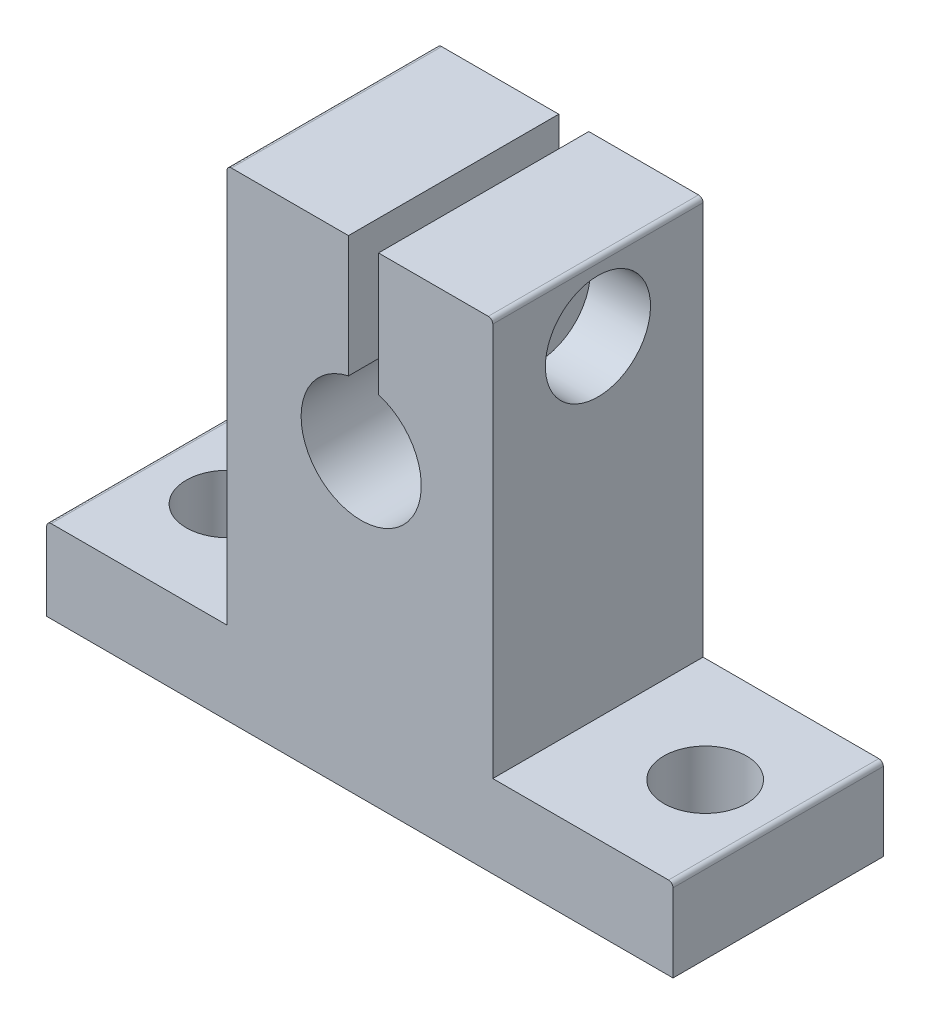
ISO-10303-21;
HEADER;
FILE_DESCRIPTION(('STEP AP214'),'2;1');
FILE_NAME('part.step','',(''),(''),'','','');
FILE_SCHEMA(('AUTOMOTIVE_DESIGN { 1 0 10303 214 1 1 1 1 }'));
ENDSEC;
DATA;
#1=APPLICATION_CONTEXT('core data for automotive mechanical design processes');
#2=APPLICATION_PROTOCOL_DEFINITION('international standard','automotive_design',2000,#1);
#3=PRODUCT_CONTEXT('',#1,'mechanical');
#4=PRODUCT('Part','Part','',(#3));
#5=PRODUCT_RELATED_PRODUCT_CATEGORY('part','',(#4));
#6=PRODUCT_DEFINITION_FORMATION('','',#4);
#7=PRODUCT_DEFINITION_CONTEXT('part definition',#1,'design');
#8=PRODUCT_DEFINITION('design','',#6,#7);
#9=PRODUCT_DEFINITION_SHAPE('','',#8);
#10=(LENGTH_UNIT() NAMED_UNIT(*) SI_UNIT(.MILLI.,.METRE.));
#11=(NAMED_UNIT(*) PLANE_ANGLE_UNIT() SI_UNIT($,.RADIAN.));
#12=(NAMED_UNIT(*) SI_UNIT($,.STERADIAN.) SOLID_ANGLE_UNIT());
#13=UNCERTAINTY_MEASURE_WITH_UNIT(LENGTH_MEASURE(1.E-05),#10,'distance_accuracy_value','');
#14=(GEOMETRIC_REPRESENTATION_CONTEXT(3) GLOBAL_UNCERTAINTY_ASSIGNED_CONTEXT((#13)) GLOBAL_UNIT_ASSIGNED_CONTEXT((#10,
#11,#12)) REPRESENTATION_CONTEXT('',''));
#15=CARTESIAN_POINT('',(0.,0.,0.));
#16=DIRECTION('',(0.,0.,1.));
#17=DIRECTION('',(1.,0.,0.));
#18=AXIS2_PLACEMENT_3D('',#15,#16,#17);
#19=CARTESIAN_POINT('',(-0.238905162453727,22.7864033921109,7.));
#20=DIRECTION('',(1.,0.,0.));
#21=DIRECTION('',(0.,1.,0.));
#22=AXIS2_PLACEMENT_3D('',#19,#20,#21);
#23=CYLINDRICAL_SURFACE('',#22,2.);
#24=CARTESIAN_POINT('',(1.15263000144478,22.7864033921109,7.));
#25=DIRECTION('',(1.,0.,0.));
#26=DIRECTION('',(0.,0.,-1.));
#27=AXIS2_PLACEMENT_3D('',#24,#25,#26);
#28=CIRCLE('',#27,2.);
#29=CARTESIAN_POINT('',(1.15263000144478,22.7864033921109,5.));
#30=VERTEX_POINT('',#29);
#31=EDGE_CURVE('E167',#30,#30,#28,.T.);
#32=ORIENTED_EDGE('',*,*,#31,.F.);
#33=EDGE_LOOP('',(#32));
#34=FACE_BOUND('',#33,.T.);
#35=CARTESIAN_POINT('',(4.76109483754627,22.7864033921109,7.));
#36=DIRECTION('',(1.,0.,0.));
#37=DIRECTION('',(0.,1.,0.));
#38=AXIS2_PLACEMENT_3D('',#35,#36,#37);
#39=CIRCLE('',#38,2.);
#40=CARTESIAN_POINT('',(4.76109483754627,24.7864033921109,7.));
#41=VERTEX_POINT('',#40);
#42=EDGE_CURVE('E236',#41,#41,#39,.F.);
#43=ORIENTED_EDGE('',*,*,#42,.F.);
#44=EDGE_LOOP('',(#43));
#45=FACE_BOUND('',#44,.T.);
#46=ADVANCED_FACE('F32',(#34,#45),#23,.F.);
#47=CARTESIAN_POINT('',(-8.93890516245373,27.2864033921109,14.));
#48=DIRECTION('',(0.,-1.,0.));
#49=DIRECTION('',(1.,0.,0.));
#50=AXIS2_PLACEMENT_3D('',#47,#48,#49);
#51=PLANE('',#50);
#52=DIRECTION('',(-1.,0.,0.));
#53=VECTOR('',#52,1.);
#54=CARTESIAN_POINT('',(-8.93890516245373,27.2864033921109,14.));
#55=LINE('',#54,#53);
#56=CARTESIAN_POINT('',(8.46109483754627,27.2864033921109,14.));
#57=VERTEX_POINT('',#56);
#58=CARTESIAN_POINT('',(1.15263000144478,27.2864033921109,14.));
#59=VERTEX_POINT('',#58);
#60=EDGE_CURVE('E165',#57,#59,#55,.T.);
#61=ORIENTED_EDGE('',*,*,#60,.F.);
#62=DIRECTION('',(0.,0.,-1.));
#63=VECTOR('',#62,1.);
#64=CARTESIAN_POINT('',(8.46109483754627,27.2864033921109,14.));
#65=LINE('',#64,#63);
#66=CARTESIAN_POINT('',(8.46109483754627,27.2864033921109,0.));
#67=VERTEX_POINT('',#66);
#68=EDGE_CURVE('E40',#57,#67,#65,.T.);
#69=ORIENTED_EDGE('',*,*,#68,.T.);
#70=DIRECTION('',(-1.,0.,0.));
#71=VECTOR('',#70,1.);
#72=CARTESIAN_POINT('',(-8.93890516245373,27.2864033921109,0.));
#73=LINE('',#72,#71);
#74=CARTESIAN_POINT('',(1.15263000144478,27.2864033921109,0.));
#75=VERTEX_POINT('',#74);
#76=EDGE_CURVE('E206',#67,#75,#73,.T.);
#77=ORIENTED_EDGE('',*,*,#76,.T.);
#78=DIRECTION('',(0.,0.,1.));
#79=VECTOR('',#78,1.);
#80=CARTESIAN_POINT('',(1.15263000144478,27.2864033921109,14.));
#81=LINE('',#80,#79);
#82=EDGE_CURVE('E294',#75,#59,#81,.T.);
#83=ORIENTED_EDGE('',*,*,#82,.T.);
#84=EDGE_LOOP('',(#61,#69,#77,#83));
#85=FACE_BOUND('',#84,.T.);
#86=ADVANCED_FACE('F277',(#85),#51,.F.);
#87=CARTESIAN_POINT('',(0.,0.,14.));
#88=DIRECTION('',(0.,0.,1.));
#89=DIRECTION('',(1.,0.,0.));
#90=AXIS2_PLACEMENT_3D('',#87,#88,#89);
#91=PLANE('',#90);
#92=DIRECTION('',(-1.,0.,0.));
#93=VECTOR('',#92,1.);
#94=CARTESIAN_POINT('',(-20.9389051624537,0.786403392110909,14.));
#95=LINE('',#94,#93);
#96=CARTESIAN_POINT('',(-8.93890516245373,0.786403392110911,14.));
#97=VERTEX_POINT('',#96);
#98=CARTESIAN_POINT('',(-20.6389051624537,0.786403392110909,14.));
#99=VERTEX_POINT('',#98);
#100=EDGE_CURVE('E195',#97,#99,#95,.T.);
#101=ORIENTED_EDGE('',*,*,#100,.T.);
#102=CARTESIAN_POINT('',(-20.6389051624537,0.48640339211091,14.));
#103=DIRECTION('',(0.,0.,1.));
#104=DIRECTION('',(1.,0.,0.));
#105=AXIS2_PLACEMENT_3D('',#102,#103,#104);
#106=CIRCLE('',#105,0.3);
#107=CARTESIAN_POINT('',(-20.9389051624537,0.48640339211091,14.));
#108=VERTEX_POINT('',#107);
#109=EDGE_CURVE('E262',#99,#108,#106,.T.);
#110=ORIENTED_EDGE('',*,*,#109,.T.);
#111=DIRECTION('',(0.,-1.,0.));
#112=VECTOR('',#111,1.);
#113=CARTESIAN_POINT('',(-20.9389051624537,0.786403392110909,14.));
#114=LINE('',#113,#112);
#115=CARTESIAN_POINT('',(-20.9389051624537,-4.71359660788909,14.));
#116=VERTEX_POINT('',#115);
#117=EDGE_CURVE('E197',#108,#116,#114,.T.);
#118=ORIENTED_EDGE('',*,*,#117,.T.);
#119=DIRECTION('',(1.,0.,0.));
#120=VECTOR('',#119,1.);
#121=CARTESIAN_POINT('',(-20.9389051624537,-4.71359660788909,14.));
#122=LINE('',#121,#120);
#123=CARTESIAN_POINT('',(20.7610948375463,-4.71359660788909,14.));
#124=VERTEX_POINT('',#123);
#125=EDGE_CURVE('E199',#116,#124,#122,.T.);
#126=ORIENTED_EDGE('',*,*,#125,.T.);
#127=DIRECTION('',(0.,1.,0.));
#128=VECTOR('',#127,1.);
#129=CARTESIAN_POINT('',(20.7610948375463,0.786403392110909,14.));
#130=LINE('',#129,#128);
#131=CARTESIAN_POINT('',(20.7610948375463,0.486403392110909,14.));
#132=VERTEX_POINT('',#131);
#133=EDGE_CURVE('E183',#124,#132,#130,.T.);
#134=ORIENTED_EDGE('',*,*,#133,.T.);
#135=CARTESIAN_POINT('',(20.4610948375463,0.486403392110909,14.));
#136=DIRECTION('',(0.,0.,1.));
#137=DIRECTION('',(1.,0.,0.));
#138=AXIS2_PLACEMENT_3D('',#135,#136,#137);
#139=CIRCLE('',#138,0.3);
#140=CARTESIAN_POINT('',(20.4610948375463,0.786403392110909,14.));
#141=VERTEX_POINT('',#140);
#142=EDGE_CURVE('E260',#132,#141,#139,.T.);
#143=ORIENTED_EDGE('',*,*,#142,.T.);
#144=DIRECTION('',(-1.,0.,0.));
#145=VECTOR('',#144,1.);
#146=CARTESIAN_POINT('',(8.76109483754628,0.786403392110909,14.));
#147=LINE('',#146,#145);
#148=CARTESIAN_POINT('',(8.76109483754628,0.786403392110909,14.));
#149=VERTEX_POINT('',#148);
#150=EDGE_CURVE('E186',#141,#149,#147,.T.);
#151=ORIENTED_EDGE('',*,*,#150,.T.);
#152=DIRECTION('',(0.,1.,0.));
#153=VECTOR('',#152,1.);
#154=CARTESIAN_POINT('',(8.76109483754627,27.2864033921109,14.));
#155=LINE('',#154,#153);
#156=CARTESIAN_POINT('',(8.76109483754627,26.9864033921109,14.));
#157=VERTEX_POINT('',#156);
#158=EDGE_CURVE('E189',#149,#157,#155,.T.);
#159=ORIENTED_EDGE('',*,*,#158,.T.);
#160=CARTESIAN_POINT('',(8.46109483754627,26.9864033921109,14.));
#161=DIRECTION('',(0.,0.,1.));
#162=DIRECTION('',(1.,0.,0.));
#163=AXIS2_PLACEMENT_3D('',#160,#161,#162);
#164=CIRCLE('',#163,0.3);
#165=EDGE_CURVE('E47',#157,#57,#164,.T.);
#166=ORIENTED_EDGE('',*,*,#165,.T.);
#167=ORIENTED_EDGE('',*,*,#60,.T.);
#168=DIRECTION('',(0.,1.,0.));
#169=VECTOR('',#168,1.);
#170=CARTESIAN_POINT('',(1.15263000144478,29.6829816442185,14.));
#171=LINE('',#170,#169);
#172=CARTESIAN_POINT('',(1.15263000144478,19.116735503008,14.));
#173=VERTEX_POINT('',#172);
#174=EDGE_CURVE('E149',#173,#59,#171,.T.);
#175=ORIENTED_EDGE('',*,*,#174,.F.);
#176=CARTESIAN_POINT('',(0.,15.2864033921109,14.));
#177=DIRECTION('',(0.,0.,1.));
#178=DIRECTION('',(1.,0.,0.));
#179=AXIS2_PLACEMENT_3D('',#176,#177,#178);
#180=CIRCLE('',#179,4.);
#181=CARTESIAN_POINT('',(-0.847369998555217,19.1956186695737,14.));
#182=VERTEX_POINT('',#181);
#183=EDGE_CURVE('E164',#182,#173,#180,.T.);
#184=ORIENTED_EDGE('',*,*,#183,.F.);
#185=DIRECTION('',(0.,-1.,0.));
#186=VECTOR('',#185,1.);
#187=CARTESIAN_POINT('',(-0.847369998555218,29.6829816442185,14.));
#188=LINE('',#187,#186);
#189=CARTESIAN_POINT('',(-0.847369998555218,27.2864033921109,14.));
#190=VERTEX_POINT('',#189);
#191=EDGE_CURVE('E166',#190,#182,#188,.T.);
#192=ORIENTED_EDGE('',*,*,#191,.F.);
#193=CARTESIAN_POINT('',(-8.63890516245373,27.2864033921109,14.));
#194=VERTEX_POINT('',#193);
#195=EDGE_CURVE('E191',#190,#194,#55,.T.);
#196=ORIENTED_EDGE('',*,*,#195,.T.);
#197=CARTESIAN_POINT('',(-8.63890516245373,26.9864033921109,14.));
#198=DIRECTION('',(0.,0.,1.));
#199=DIRECTION('',(1.,0.,0.));
#200=AXIS2_PLACEMENT_3D('',#197,#198,#199);
#201=CIRCLE('',#200,0.3);
#202=CARTESIAN_POINT('',(-8.93890516245373,26.9864033921109,14.));
#203=VERTEX_POINT('',#202);
#204=EDGE_CURVE('E258',#194,#203,#201,.T.);
#205=ORIENTED_EDGE('',*,*,#204,.T.);
#206=DIRECTION('',(0.,-1.,0.));
#207=VECTOR('',#206,1.);
#208=CARTESIAN_POINT('',(-8.93890516245373,27.2864033921109,14.));
#209=LINE('',#208,#207);
#210=EDGE_CURVE('E193',#203,#97,#209,.T.);
#211=ORIENTED_EDGE('',*,*,#210,.T.);
#212=EDGE_LOOP('',(#101,#110,#118,#126,#134,#143,#151,#159,#166,#167,#175,#184,#192,#196,#205,#211));
#213=FACE_BOUND('',#212,.T.);
#214=ADVANCED_FACE('F162',(#213),#91,.T.);
#215=CARTESIAN_POINT('',(0.,0.,0.));
#216=DIRECTION('',(0.,0.,1.));
#217=DIRECTION('',(1.,0.,0.));
#218=AXIS2_PLACEMENT_3D('',#215,#216,#217);
#219=PLANE('',#218);
#220=DIRECTION('',(0.,-1.,0.));
#221=VECTOR('',#220,1.);
#222=CARTESIAN_POINT('',(-20.9389051624537,0.786403392110909,0.));
#223=LINE('',#222,#221);
#224=CARTESIAN_POINT('',(-20.9389051624537,0.48640339211091,0.));
#225=VERTEX_POINT('',#224);
#226=CARTESIAN_POINT('',(-20.9389051624537,-4.71359660788909,0.));
#227=VERTEX_POINT('',#226);
#228=EDGE_CURVE('E213',#225,#227,#223,.T.);
#229=ORIENTED_EDGE('',*,*,#228,.F.);
#230=CARTESIAN_POINT('',(-20.6389051624537,0.48640339211091,0.));
#231=DIRECTION('',(0.,0.,1.));
#232=DIRECTION('',(1.,0.,0.));
#233=AXIS2_PLACEMENT_3D('',#230,#231,#232);
#234=CIRCLE('',#233,0.3);
#235=CARTESIAN_POINT('',(-20.6389051624537,0.786403392110909,0.));
#236=VERTEX_POINT('',#235);
#237=EDGE_CURVE('E253',#225,#236,#234,.F.);
#238=ORIENTED_EDGE('',*,*,#237,.T.);
#239=DIRECTION('',(-1.,0.,0.));
#240=VECTOR('',#239,1.);
#241=CARTESIAN_POINT('',(-20.9389051624537,0.786403392110909,0.));
#242=LINE('',#241,#240);
#243=CARTESIAN_POINT('',(-8.93890516245373,0.786403392110911,0.));
#244=VERTEX_POINT('',#243);
#245=EDGE_CURVE('E210',#244,#236,#242,.T.);
#246=ORIENTED_EDGE('',*,*,#245,.F.);
#247=DIRECTION('',(0.,-1.,0.));
#248=VECTOR('',#247,1.);
#249=CARTESIAN_POINT('',(-8.93890516245373,27.2864033921109,0.));
#250=LINE('',#249,#248);
#251=CARTESIAN_POINT('',(-8.93890516245373,26.9864033921109,0.));
#252=VERTEX_POINT('',#251);
#253=EDGE_CURVE('E208',#252,#244,#250,.T.);
#254=ORIENTED_EDGE('',*,*,#253,.F.);
#255=CARTESIAN_POINT('',(-8.63890516245373,26.9864033921109,0.));
#256=DIRECTION('',(0.,0.,1.));
#257=DIRECTION('',(1.,0.,0.));
#258=AXIS2_PLACEMENT_3D('',#255,#256,#257);
#259=CIRCLE('',#258,0.3);
#260=CARTESIAN_POINT('',(-8.63890516245373,27.2864033921109,0.));
#261=VERTEX_POINT('',#260);
#262=EDGE_CURVE('E249',#252,#261,#259,.F.);
#263=ORIENTED_EDGE('',*,*,#262,.T.);
#264=CARTESIAN_POINT('',(-0.847369998555218,27.2864033921109,0.));
#265=VERTEX_POINT('',#264);
#266=EDGE_CURVE('E205',#265,#261,#73,.T.);
#267=ORIENTED_EDGE('',*,*,#266,.F.);
#268=DIRECTION('',(0.,-1.,0.));
#269=VECTOR('',#268,1.);
#270=CARTESIAN_POINT('',(-0.847369998555218,29.6829816442185,0.));
#271=LINE('',#270,#269);
#272=CARTESIAN_POINT('',(-0.847369998555217,19.1956186695737,0.));
#273=VERTEX_POINT('',#272);
#274=EDGE_CURVE('E284',#265,#273,#271,.T.);
#275=ORIENTED_EDGE('',*,*,#274,.T.);
#276=CARTESIAN_POINT('',(0.,15.2864033921109,0.));
#277=DIRECTION('',(0.,0.,1.));
#278=DIRECTION('',(1.,0.,0.));
#279=AXIS2_PLACEMENT_3D('',#276,#277,#278);
#280=CIRCLE('',#279,4.);
#281=CARTESIAN_POINT('',(1.15263000144478,19.116735503008,0.));
#282=VERTEX_POINT('',#281);
#283=EDGE_CURVE('E172',#273,#282,#280,.T.);
#284=ORIENTED_EDGE('',*,*,#283,.T.);
#285=DIRECTION('',(0.,1.,0.));
#286=VECTOR('',#285,1.);
#287=CARTESIAN_POINT('',(1.15263000144478,29.6829816442185,0.));
#288=LINE('',#287,#286);
#289=EDGE_CURVE('E152',#282,#75,#288,.T.);
#290=ORIENTED_EDGE('',*,*,#289,.T.);
#291=ORIENTED_EDGE('',*,*,#76,.F.);
#292=CARTESIAN_POINT('',(8.46109483754627,26.9864033921109,0.));
#293=DIRECTION('',(0.,0.,1.));
#294=DIRECTION('',(1.,0.,0.));
#295=AXIS2_PLACEMENT_3D('',#292,#293,#294);
#296=CIRCLE('',#295,0.3);
#297=CARTESIAN_POINT('',(8.76109483754627,26.9864033921109,0.));
#298=VERTEX_POINT('',#297);
#299=EDGE_CURVE('E247',#67,#298,#296,.F.);
#300=ORIENTED_EDGE('',*,*,#299,.T.);
#301=DIRECTION('',(0.,1.,0.));
#302=VECTOR('',#301,1.);
#303=CARTESIAN_POINT('',(8.76109483754627,27.2864033921109,0.));
#304=LINE('',#303,#302);
#305=CARTESIAN_POINT('',(8.76109483754628,0.786403392110909,0.));
#306=VERTEX_POINT('',#305);
#307=EDGE_CURVE('E203',#306,#298,#304,.T.);
#308=ORIENTED_EDGE('',*,*,#307,.F.);
#309=DIRECTION('',(-1.,0.,0.));
#310=VECTOR('',#309,1.);
#311=CARTESIAN_POINT('',(8.76109483754628,0.786403392110909,0.));
#312=LINE('',#311,#310);
#313=CARTESIAN_POINT('',(20.4610948375463,0.786403392110909,0.));
#314=VERTEX_POINT('',#313);
#315=EDGE_CURVE('E175',#314,#306,#312,.T.);
#316=ORIENTED_EDGE('',*,*,#315,.F.);
#317=CARTESIAN_POINT('',(20.4610948375463,0.486403392110909,0.));
#318=DIRECTION('',(0.,0.,1.));
#319=DIRECTION('',(1.,0.,0.));
#320=AXIS2_PLACEMENT_3D('',#317,#318,#319);
#321=CIRCLE('',#320,0.3);
#322=CARTESIAN_POINT('',(20.7610948375463,0.486403392110909,0.));
#323=VERTEX_POINT('',#322);
#324=EDGE_CURVE('E251',#314,#323,#321,.F.);
#325=ORIENTED_EDGE('',*,*,#324,.T.);
#326=DIRECTION('',(0.,1.,0.));
#327=VECTOR('',#326,1.);
#328=CARTESIAN_POINT('',(20.7610948375463,0.786403392110909,0.));
#329=LINE('',#328,#327);
#330=CARTESIAN_POINT('',(20.7610948375463,-4.71359660788909,0.));
#331=VERTEX_POINT('',#330);
#332=EDGE_CURVE('E171',#331,#323,#329,.T.);
#333=ORIENTED_EDGE('',*,*,#332,.F.);
#334=DIRECTION('',(1.,0.,0.));
#335=VECTOR('',#334,1.);
#336=CARTESIAN_POINT('',(-20.9389051624537,-4.71359660788909,0.));
#337=LINE('',#336,#335);
#338=EDGE_CURVE('E187',#227,#331,#337,.T.);
#339=ORIENTED_EDGE('',*,*,#338,.F.);
#340=EDGE_LOOP('',(#229,#238,#246,#254,#263,#267,#275,#284,#290,#291,#300,#308,#316,#325,#333,#339));
#341=FACE_BOUND('',#340,.T.);
#342=ADVANCED_FACE('F281',(#341),#219,.F.);
#343=CARTESIAN_POINT('',(20.7610948375463,0.786403392110909,14.));
#344=DIRECTION('',(-1.,0.,0.));
#345=DIRECTION('',(0.,0.,1.));
#346=AXIS2_PLACEMENT_3D('',#343,#344,#345);
#347=PLANE('',#346);
#348=ORIENTED_EDGE('',*,*,#332,.T.);
#349=DIRECTION('',(0.,0.,-1.));
#350=VECTOR('',#349,1.);
#351=CARTESIAN_POINT('',(20.7610948375463,0.486403392110909,14.));
#352=LINE('',#351,#350);
#353=EDGE_CURVE('E267',#323,#132,#352,.F.);
#354=ORIENTED_EDGE('',*,*,#353,.T.);
#355=ORIENTED_EDGE('',*,*,#133,.F.);
#356=DIRECTION('',(0.,0.,-1.));
#357=VECTOR('',#356,1.);
#358=CARTESIAN_POINT('',(20.7610948375463,-4.71359660788909,14.));
#359=LINE('',#358,#357);
#360=EDGE_CURVE('E200',#124,#331,#359,.T.);
#361=ORIENTED_EDGE('',*,*,#360,.T.);
#362=EDGE_LOOP('',(#348,#354,#355,#361));
#363=FACE_BOUND('',#362,.T.);
#364=ADVANCED_FACE('F305',(#363),#347,.F.);
#365=CARTESIAN_POINT('',(8.76109483754628,0.786403392110909,14.));
#366=DIRECTION('',(0.,-1.,0.));
#367=DIRECTION('',(0.,0.,-1.));
#368=AXIS2_PLACEMENT_3D('',#365,#366,#367);
#369=PLANE('',#368);
#370=CARTESIAN_POINT('',(15.9,0.786403392110909,7.));
#371=DIRECTION('',(0.,1.,0.));
#372=DIRECTION('',(0.,0.,1.));
#373=AXIS2_PLACEMENT_3D('',#370,#371,#372);
#374=CIRCLE('',#373,2.75);
#375=CARTESIAN_POINT('',(15.9,0.786403392110909,9.75));
#376=VERTEX_POINT('',#375);
#377=EDGE_CURVE('E232',#376,#376,#374,.T.);
#378=ORIENTED_EDGE('',*,*,#377,.F.);
#379=EDGE_LOOP('',(#378));
#380=FACE_BOUND('',#379,.T.);
#381=ORIENTED_EDGE('',*,*,#150,.F.);
#382=DIRECTION('',(0.,0.,-1.));
#383=VECTOR('',#382,1.);
#384=CARTESIAN_POINT('',(20.4610948375463,0.786403392110909,14.));
#385=LINE('',#384,#383);
#386=EDGE_CURVE('E264',#141,#314,#385,.T.);
#387=ORIENTED_EDGE('',*,*,#386,.T.);
#388=ORIENTED_EDGE('',*,*,#315,.T.);
#389=DIRECTION('',(0.,0.,-1.));
#390=VECTOR('',#389,1.);
#391=CARTESIAN_POINT('',(8.76109483754628,0.786403392110909,14.));
#392=LINE('',#391,#390);
#393=EDGE_CURVE('E224',#149,#306,#392,.T.);
#394=ORIENTED_EDGE('',*,*,#393,.F.);
#395=EDGE_LOOP('',(#381,#387,#388,#394));
#396=FACE_BOUND('',#395,.T.);
#397=ADVANCED_FACE('F301',(#380,#396),#369,.F.);
#398=CARTESIAN_POINT('',(8.76109483754627,27.2864033921109,14.));
#399=DIRECTION('',(-1.,0.,0.));
#400=DIRECTION('',(0.,-1.,0.));
#401=AXIS2_PLACEMENT_3D('',#398,#399,#400);
#402=PLANE('',#401);
#403=CARTESIAN_POINT('',(8.76109483754627,22.7864033921109,7.));
#404=DIRECTION('',(1.,0.,0.));
#405=DIRECTION('',(0.,1.,0.));
#406=AXIS2_PLACEMENT_3D('',#403,#404,#405);
#407=CIRCLE('',#406,3.5);
#408=CARTESIAN_POINT('',(8.76109483754627,26.2864033921109,7.));
#409=VERTEX_POINT('',#408);
#410=EDGE_CURVE('E243',#409,#409,#407,.T.);
#411=ORIENTED_EDGE('',*,*,#410,.F.);
#412=EDGE_LOOP('',(#411));
#413=FACE_BOUND('',#412,.T.);
#414=ORIENTED_EDGE('',*,*,#307,.T.);
#415=DIRECTION('',(0.,0.,-1.));
#416=VECTOR('',#415,1.);
#417=CARTESIAN_POINT('',(8.76109483754627,26.9864033921109,14.));
#418=LINE('',#417,#416);
#419=EDGE_CURVE('E11',#298,#157,#418,.F.);
#420=ORIENTED_EDGE('',*,*,#419,.T.);
#421=ORIENTED_EDGE('',*,*,#158,.F.);
#422=ORIENTED_EDGE('',*,*,#393,.T.);
#423=EDGE_LOOP('',(#414,#420,#421,#422));
#424=FACE_BOUND('',#423,.T.);
#425=ADVANCED_FACE('F304',(#413,#424),#402,.F.);
#426=ORIENTED_EDGE('',*,*,#266,.T.);
#427=DIRECTION('',(0.,0.,-1.));
#428=VECTOR('',#427,1.);
#429=CARTESIAN_POINT('',(-8.63890516245373,27.2864033921109,14.));
#430=LINE('',#429,#428);
#431=EDGE_CURVE('E272',#261,#194,#430,.F.);
#432=ORIENTED_EDGE('',*,*,#431,.T.);
#433=ORIENTED_EDGE('',*,*,#195,.F.);
#434=DIRECTION('',(0.,0.,-1.));
#435=VECTOR('',#434,1.);
#436=CARTESIAN_POINT('',(-0.847369998555218,27.2864033921109,14.));
#437=LINE('',#436,#435);
#438=EDGE_CURVE('E286',#190,#265,#437,.T.);
#439=ORIENTED_EDGE('',*,*,#438,.T.);
#440=EDGE_LOOP('',(#426,#432,#433,#439));
#441=FACE_BOUND('',#440,.T.);
#442=ADVANCED_FACE('F349',(#441),#51,.F.);
#443=CARTESIAN_POINT('',(-8.93890516245373,27.2864033921109,14.));
#444=DIRECTION('',(1.,0.,0.));
#445=DIRECTION('',(0.,1.,0.));
#446=AXIS2_PLACEMENT_3D('',#443,#444,#445);
#447=PLANE('',#446);
#448=CARTESIAN_POINT('',(-8.93890516245373,22.7864033921109,7.));
#449=DIRECTION('',(-1.,0.,0.));
#450=DIRECTION('',(0.,-1.,0.));
#451=AXIS2_PLACEMENT_3D('',#448,#449,#450);
#452=CIRCLE('',#451,1.85);
#453=CARTESIAN_POINT('',(-8.93890516245373,20.9364033921109,7.));
#454=VERTEX_POINT('',#453);
#455=EDGE_CURVE('E244',#454,#454,#452,.T.);
#456=ORIENTED_EDGE('',*,*,#455,.F.);
#457=EDGE_LOOP('',(#456));
#458=FACE_BOUND('',#457,.T.);
#459=ORIENTED_EDGE('',*,*,#210,.F.);
#460=DIRECTION('',(0.,0.,-1.));
#461=VECTOR('',#460,1.);
#462=CARTESIAN_POINT('',(-8.93890516245373,26.9864033921109,14.));
#463=LINE('',#462,#461);
#464=EDGE_CURVE('E269',#203,#252,#463,.T.);
#465=ORIENTED_EDGE('',*,*,#464,.T.);
#466=ORIENTED_EDGE('',*,*,#253,.T.);
#467=DIRECTION('',(0.,0.,-1.));
#468=VECTOR('',#467,1.);
#469=CARTESIAN_POINT('',(-8.93890516245373,0.786403392110911,14.));
#470=LINE('',#469,#468);
#471=EDGE_CURVE('E221',#97,#244,#470,.T.);
#472=ORIENTED_EDGE('',*,*,#471,.F.);
#473=EDGE_LOOP('',(#459,#465,#466,#472));
#474=FACE_BOUND('',#473,.T.);
#475=ADVANCED_FACE('F342',(#458,#474),#447,.F.);
#476=CARTESIAN_POINT('',(-20.9389051624537,0.786403392110909,14.));
#477=DIRECTION('',(0.,-1.,0.));
#478=DIRECTION('',(1.,0.,0.));
#479=AXIS2_PLACEMENT_3D('',#476,#477,#478);
#480=PLANE('',#479);
#481=CARTESIAN_POINT('',(-15.9,0.786403392110909,7.));
#482=DIRECTION('',(0.,1.,0.));
#483=DIRECTION('',(0.,0.,1.));
#484=AXIS2_PLACEMENT_3D('',#481,#482,#483);
#485=CIRCLE('',#484,2.75);
#486=CARTESIAN_POINT('',(-15.9,0.786403392110909,9.75));
#487=VERTEX_POINT('',#486);
#488=EDGE_CURVE('E180',#487,#487,#485,.T.);
#489=ORIENTED_EDGE('',*,*,#488,.F.);
#490=EDGE_LOOP('',(#489));
#491=FACE_BOUND('',#490,.T.);
#492=ORIENTED_EDGE('',*,*,#245,.T.);
#493=DIRECTION('',(0.,0.,-1.));
#494=VECTOR('',#493,1.);
#495=CARTESIAN_POINT('',(-20.6389051624537,0.786403392110909,14.));
#496=LINE('',#495,#494);
#497=EDGE_CURVE('E255',#236,#99,#496,.F.);
#498=ORIENTED_EDGE('',*,*,#497,.T.);
#499=ORIENTED_EDGE('',*,*,#100,.F.);
#500=ORIENTED_EDGE('',*,*,#471,.T.);
#501=EDGE_LOOP('',(#492,#498,#499,#500));
#502=FACE_BOUND('',#501,.T.);
#503=ADVANCED_FACE('F335',(#491,#502),#480,.F.);
#504=CARTESIAN_POINT('',(-20.9389051624537,0.786403392110909,14.));
#505=DIRECTION('',(1.,0.,0.));
#506=DIRECTION('',(0.,0.,-1.));
#507=AXIS2_PLACEMENT_3D('',#504,#505,#506);
#508=PLANE('',#507);
#509=ORIENTED_EDGE('',*,*,#117,.F.);
#510=DIRECTION('',(0.,0.,-1.));
#511=VECTOR('',#510,1.);
#512=CARTESIAN_POINT('',(-20.9389051624537,0.48640339211091,14.));
#513=LINE('',#512,#511);
#514=EDGE_CURVE('E157',#108,#225,#513,.T.);
#515=ORIENTED_EDGE('',*,*,#514,.T.);
#516=ORIENTED_EDGE('',*,*,#228,.T.);
#517=DIRECTION('',(0.,0.,-1.));
#518=VECTOR('',#517,1.);
#519=CARTESIAN_POINT('',(-20.9389051624537,-4.71359660788909,14.));
#520=LINE('',#519,#518);
#521=EDGE_CURVE('E218',#116,#227,#520,.T.);
#522=ORIENTED_EDGE('',*,*,#521,.F.);
#523=EDGE_LOOP('',(#509,#515,#516,#522));
#524=FACE_BOUND('',#523,.T.);
#525=ADVANCED_FACE('F327',(#524),#508,.F.);
#526=CARTESIAN_POINT('',(-20.9389051624537,-4.71359660788909,14.));
#527=DIRECTION('',(0.,1.,0.));
#528=DIRECTION('',(0.,0.,1.));
#529=AXIS2_PLACEMENT_3D('',#526,#527,#528);
#530=PLANE('',#529);
#531=CARTESIAN_POINT('',(15.9,-4.71359660788909,7.));
#532=DIRECTION('',(0.,1.,0.));
#533=DIRECTION('',(0.,0.,1.));
#534=AXIS2_PLACEMENT_3D('',#531,#532,#533);
#535=CIRCLE('',#534,2.75);
#536=CARTESIAN_POINT('',(15.9,-4.71359660788909,9.75));
#537=VERTEX_POINT('',#536);
#538=EDGE_CURVE('E229',#537,#537,#535,.T.);
#539=ORIENTED_EDGE('',*,*,#538,.T.);
#540=EDGE_LOOP('',(#539));
#541=FACE_BOUND('',#540,.T.);
#542=CARTESIAN_POINT('',(-15.9,-4.71359660788909,7.));
#543=DIRECTION('',(0.,1.,0.));
#544=DIRECTION('',(0.,0.,1.));
#545=AXIS2_PLACEMENT_3D('',#542,#543,#544);
#546=CIRCLE('',#545,2.75);
#547=CARTESIAN_POINT('',(-15.9,-4.71359660788909,9.75));
#548=VERTEX_POINT('',#547);
#549=EDGE_CURVE('E177',#548,#548,#546,.T.);
#550=ORIENTED_EDGE('',*,*,#549,.T.);
#551=EDGE_LOOP('',(#550));
#552=FACE_BOUND('',#551,.T.);
#553=ORIENTED_EDGE('',*,*,#338,.T.);
#554=ORIENTED_EDGE('',*,*,#360,.F.);
#555=ORIENTED_EDGE('',*,*,#125,.F.);
#556=ORIENTED_EDGE('',*,*,#521,.T.);
#557=EDGE_LOOP('',(#553,#554,#555,#556));
#558=FACE_BOUND('',#557,.T.);
#559=ADVANCED_FACE('F322',(#541,#552,#558),#530,.F.);
#560=CARTESIAN_POINT('',(0.,15.2864033921109,14.));
#561=DIRECTION('',(0.,0.,-1.));
#562=DIRECTION('',(-1.,0.,0.));
#563=AXIS2_PLACEMENT_3D('',#560,#561,#562);
#564=CYLINDRICAL_SURFACE('',#563,4.);
#565=DIRECTION('',(0.,0.,-1.));
#566=VECTOR('',#565,1.);
#567=CARTESIAN_POINT('',(1.15263000144478,19.116735503008,14.));
#568=LINE('',#567,#566);
#569=EDGE_CURVE('E145',#282,#173,#568,.F.);
#570=ORIENTED_EDGE('',*,*,#569,.F.);
#571=ORIENTED_EDGE('',*,*,#283,.F.);
#572=DIRECTION('',(0.,0.,-1.));
#573=VECTOR('',#572,1.);
#574=CARTESIAN_POINT('',(-0.847369998555217,19.1956186695737,14.));
#575=LINE('',#574,#573);
#576=EDGE_CURVE('E158',#182,#273,#575,.T.);
#577=ORIENTED_EDGE('',*,*,#576,.F.);
#578=ORIENTED_EDGE('',*,*,#183,.T.);
#579=EDGE_LOOP('',(#570,#571,#577,#578));
#580=FACE_BOUND('',#579,.T.);
#581=ADVANCED_FACE('F170',(#580),#564,.F.);
#582=CARTESIAN_POINT('',(-15.9,-5.21359660788909,7.));
#583=DIRECTION('',(0.,1.,0.));
#584=DIRECTION('',(0.,0.,1.));
#585=AXIS2_PLACEMENT_3D('',#582,#583,#584);
#586=CYLINDRICAL_SURFACE('',#585,2.75);
#587=ORIENTED_EDGE('',*,*,#488,.T.);
#588=EDGE_LOOP('',(#587));
#589=FACE_BOUND('',#588,.T.);
#590=ORIENTED_EDGE('',*,*,#549,.F.);
#591=EDGE_LOOP('',(#590));
#592=FACE_BOUND('',#591,.T.);
#593=ADVANCED_FACE('F381',(#589,#592),#586,.F.);
#594=CARTESIAN_POINT('',(15.9,-5.21359660788909,7.));
#595=DIRECTION('',(0.,1.,0.));
#596=DIRECTION('',(0.,0.,1.));
#597=AXIS2_PLACEMENT_3D('',#594,#595,#596);
#598=CYLINDRICAL_SURFACE('',#597,2.75);
#599=ORIENTED_EDGE('',*,*,#377,.T.);
#600=EDGE_LOOP('',(#599));
#601=FACE_BOUND('',#600,.T.);
#602=ORIENTED_EDGE('',*,*,#538,.F.);
#603=EDGE_LOOP('',(#602));
#604=FACE_BOUND('',#603,.T.);
#605=ADVANCED_FACE('F298',(#601,#604),#598,.F.);
#606=CARTESIAN_POINT('',(-0.847369998555218,29.6829816442185,0.));
#607=DIRECTION('',(-1.,0.,0.));
#608=DIRECTION('',(0.,-1.,0.));
#609=AXIS2_PLACEMENT_3D('',#606,#607,#608);
#610=PLANE('',#609);
#611=CARTESIAN_POINT('',(-0.847369998555217,22.7864033921109,7.));
#612=DIRECTION('',(-1.,0.,0.));
#613=DIRECTION('',(0.,-1.,0.));
#614=AXIS2_PLACEMENT_3D('',#611,#612,#613);
#615=CIRCLE('',#614,1.85);
#616=CARTESIAN_POINT('',(-0.847369998555217,20.9364033921109,7.));
#617=VERTEX_POINT('',#616);
#618=EDGE_CURVE('E240',#617,#617,#615,.T.);
#619=ORIENTED_EDGE('',*,*,#618,.T.);
#620=EDGE_LOOP('',(#619));
#621=FACE_BOUND('',#620,.T.);
#622=ORIENTED_EDGE('',*,*,#191,.T.);
#623=ORIENTED_EDGE('',*,*,#576,.T.);
#624=ORIENTED_EDGE('',*,*,#274,.F.);
#625=ORIENTED_EDGE('',*,*,#438,.F.);
#626=EDGE_LOOP('',(#622,#623,#624,#625));
#627=FACE_BOUND('',#626,.T.);
#628=ADVANCED_FACE('F371',(#621,#627),#610,.F.);
#629=CARTESIAN_POINT('',(1.15263000144478,29.6829816442185,0.));
#630=DIRECTION('',(1.,0.,0.));
#631=DIRECTION('',(0.,0.,-1.));
#632=AXIS2_PLACEMENT_3D('',#629,#630,#631);
#633=PLANE('',#632);
#634=ORIENTED_EDGE('',*,*,#31,.T.);
#635=EDGE_LOOP('',(#634));
#636=FACE_BOUND('',#635,.T.);
#637=ORIENTED_EDGE('',*,*,#289,.F.);
#638=ORIENTED_EDGE('',*,*,#569,.T.);
#639=ORIENTED_EDGE('',*,*,#174,.T.);
#640=ORIENTED_EDGE('',*,*,#82,.F.);
#641=EDGE_LOOP('',(#637,#638,#639,#640));
#642=FACE_BOUND('',#641,.T.);
#643=ADVANCED_FACE('F147',(#636,#642),#633,.F.);
#644=CARTESIAN_POINT('',(4.76109483754627,22.7864033921109,7.));
#645=DIRECTION('',(1.,0.,0.));
#646=DIRECTION('',(0.,1.,0.));
#647=AXIS2_PLACEMENT_3D('',#644,#645,#646);
#648=PLANE('',#647);
#649=CARTESIAN_POINT('',(4.76109483754627,22.7864033921109,7.));
#650=DIRECTION('',(1.,0.,0.));
#651=DIRECTION('',(0.,1.,0.));
#652=AXIS2_PLACEMENT_3D('',#649,#650,#651);
#653=CIRCLE('',#652,3.5);
#654=CARTESIAN_POINT('',(4.76109483754627,26.2864033921109,7.));
#655=VERTEX_POINT('',#654);
#656=EDGE_CURVE('E239',#655,#655,#653,.T.);
#657=ORIENTED_EDGE('',*,*,#656,.T.);
#658=EDGE_LOOP('',(#657));
#659=FACE_BOUND('',#658,.T.);
#660=ORIENTED_EDGE('',*,*,#42,.T.);
#661=EDGE_LOOP('',(#660));
#662=FACE_BOUND('',#661,.T.);
#663=ADVANCED_FACE('F377',(#659,#662),#648,.T.);
#664=CARTESIAN_POINT('',(4.76109483754627,22.7864033921109,7.));
#665=DIRECTION('',(1.,0.,0.));
#666=DIRECTION('',(0.,1.,0.));
#667=AXIS2_PLACEMENT_3D('',#664,#665,#666);
#668=CYLINDRICAL_SURFACE('',#667,3.5);
#669=ORIENTED_EDGE('',*,*,#656,.F.);
#670=EDGE_LOOP('',(#669));
#671=FACE_BOUND('',#670,.T.);
#672=ORIENTED_EDGE('',*,*,#410,.T.);
#673=EDGE_LOOP('',(#672));
#674=FACE_BOUND('',#673,.T.);
#675=ADVANCED_FACE('F369',(#671,#674),#668,.F.);
#676=CARTESIAN_POINT('',(0.0610948375462713,22.7864033921109,7.));
#677=DIRECTION('',(-1.,0.,0.));
#678=DIRECTION('',(0.,-1.,0.));
#679=AXIS2_PLACEMENT_3D('',#676,#677,#678);
#680=CYLINDRICAL_SURFACE('',#679,1.85);
#681=ORIENTED_EDGE('',*,*,#455,.T.);
#682=EDGE_LOOP('',(#681));
#683=FACE_BOUND('',#682,.T.);
#684=ORIENTED_EDGE('',*,*,#618,.F.);
#685=EDGE_LOOP('',(#684));
#686=FACE_BOUND('',#685,.T.);
#687=ADVANCED_FACE('F409',(#683,#686),#680,.F.);
#688=CARTESIAN_POINT('',(-20.6389051624537,0.48640339211091,14.));
#689=DIRECTION('',(0.,0.,-1.));
#690=DIRECTION('',(-1.,0.,0.));
#691=AXIS2_PLACEMENT_3D('',#688,#689,#690);
#692=CYLINDRICAL_SURFACE('',#691,0.3);
#693=ORIENTED_EDGE('',*,*,#109,.F.);
#694=ORIENTED_EDGE('',*,*,#497,.F.);
#695=ORIENTED_EDGE('',*,*,#237,.F.);
#696=ORIENTED_EDGE('',*,*,#514,.F.);
#697=EDGE_LOOP('',(#693,#694,#695,#696));
#698=FACE_BOUND('',#697,.T.);
#699=ADVANCED_FACE('F331',(#698),#692,.T.);
#700=CARTESIAN_POINT('',(20.4610948375463,0.486403392110909,14.));
#701=DIRECTION('',(0.,0.,-1.));
#702=DIRECTION('',(-1.,0.,0.));
#703=AXIS2_PLACEMENT_3D('',#700,#701,#702);
#704=CYLINDRICAL_SURFACE('',#703,0.3);
#705=ORIENTED_EDGE('',*,*,#142,.F.);
#706=ORIENTED_EDGE('',*,*,#353,.F.);
#707=ORIENTED_EDGE('',*,*,#324,.F.);
#708=ORIENTED_EDGE('',*,*,#386,.F.);
#709=EDGE_LOOP('',(#705,#706,#707,#708));
#710=FACE_BOUND('',#709,.T.);
#711=ADVANCED_FACE('F313',(#710),#704,.T.);
#712=CARTESIAN_POINT('',(-8.63890516245373,26.9864033921109,14.));
#713=DIRECTION('',(0.,0.,-1.));
#714=DIRECTION('',(-1.,0.,0.));
#715=AXIS2_PLACEMENT_3D('',#712,#713,#714);
#716=CYLINDRICAL_SURFACE('',#715,0.3);
#717=ORIENTED_EDGE('',*,*,#204,.F.);
#718=ORIENTED_EDGE('',*,*,#431,.F.);
#719=ORIENTED_EDGE('',*,*,#262,.F.);
#720=ORIENTED_EDGE('',*,*,#464,.F.);
#721=EDGE_LOOP('',(#717,#718,#719,#720));
#722=FACE_BOUND('',#721,.T.);
#723=ADVANCED_FACE('F351',(#722),#716,.T.);
#724=CARTESIAN_POINT('',(8.46109483754627,26.9864033921109,14.));
#725=DIRECTION('',(0.,0.,-1.));
#726=DIRECTION('',(-1.,0.,0.));
#727=AXIS2_PLACEMENT_3D('',#724,#725,#726);
#728=CYLINDRICAL_SURFACE('',#727,0.3);
#729=ORIENTED_EDGE('',*,*,#165,.F.);
#730=ORIENTED_EDGE('',*,*,#419,.F.);
#731=ORIENTED_EDGE('',*,*,#299,.F.);
#732=ORIENTED_EDGE('',*,*,#68,.F.);
#733=EDGE_LOOP('',(#729,#730,#731,#732));
#734=FACE_BOUND('',#733,.T.);
#735=ADVANCED_FACE('F34',(#734),#728,.T.);
#736=CLOSED_SHELL('',(#46,#86,#214,#342,#364,#397,#425,#442,#475,#503,#525,#559,#581,#593,#605,
#628,#643,#663,#675,#687,#699,#711,#723,#735));
#737=MANIFOLD_SOLID_BREP('B2',#736);
#738=ADVANCED_BREP_SHAPE_REPRESENTATION('',(#18,#737),#14);
#739=SHAPE_DEFINITION_REPRESENTATION(#9,#738);
ENDSEC;
END-ISO-10303-21;
